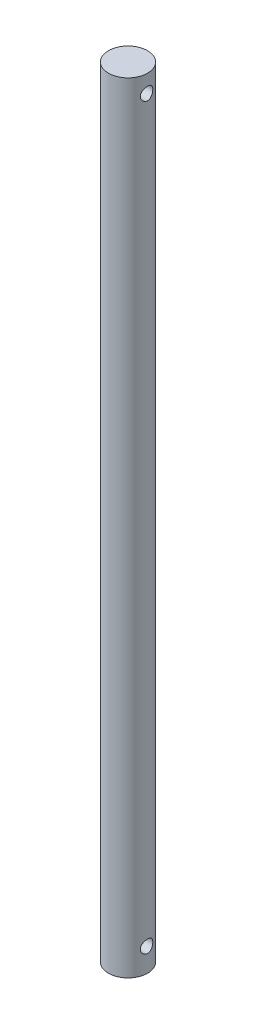
ISO-10303-21;
HEADER;
FILE_DESCRIPTION(('STEP AP214'),'2;1');
FILE_NAME('part.step','',(''),(''),'','','');
FILE_SCHEMA(('AUTOMOTIVE_DESIGN { 1 0 10303 214 1 1 1 1 }'));
ENDSEC;
DATA;
#1=APPLICATION_CONTEXT('core data for automotive mechanical design processes');
#2=APPLICATION_PROTOCOL_DEFINITION('international standard','automotive_design',2000,#1);
#3=PRODUCT_CONTEXT('',#1,'mechanical');
#4=PRODUCT('Part','Part','',(#3));
#5=PRODUCT_RELATED_PRODUCT_CATEGORY('part','',(#4));
#6=PRODUCT_DEFINITION_FORMATION('','',#4);
#7=PRODUCT_DEFINITION_CONTEXT('part definition',#1,'design');
#8=PRODUCT_DEFINITION('design','',#6,#7);
#9=PRODUCT_DEFINITION_SHAPE('','',#8);
#10=(LENGTH_UNIT() NAMED_UNIT(*) SI_UNIT(.MILLI.,.METRE.));
#11=(NAMED_UNIT(*) PLANE_ANGLE_UNIT() SI_UNIT($,.RADIAN.));
#12=(NAMED_UNIT(*) SI_UNIT($,.STERADIAN.) SOLID_ANGLE_UNIT());
#13=UNCERTAINTY_MEASURE_WITH_UNIT(LENGTH_MEASURE(1.E-05),#10,'distance_accuracy_value','');
#14=(GEOMETRIC_REPRESENTATION_CONTEXT(3) GLOBAL_UNCERTAINTY_ASSIGNED_CONTEXT((#13)) GLOBAL_UNIT_ASSIGNED_CONTEXT((#10,
#11,#12)) REPRESENTATION_CONTEXT('',''));
#15=CARTESIAN_POINT('',(0.,0.,0.));
#16=DIRECTION('',(0.,0.,1.));
#17=DIRECTION('',(1.,0.,0.));
#18=AXIS2_PLACEMENT_3D('',#15,#16,#17);
#19=CARTESIAN_POINT('',(0.,399.034,0.));
#20=DIRECTION('',(0.,-1.,0.));
#21=DIRECTION('',(0.,0.,-1.));
#22=AXIS2_PLACEMENT_3D('',#19,#20,#21);
#23=PLANE('',#22);
#24=CARTESIAN_POINT('',(0.,399.034,0.));
#25=DIRECTION('',(0.,-1.,0.));
#26=DIRECTION('',(0.,0.,-1.));
#27=AXIS2_PLACEMENT_3D('',#24,#25,#26);
#28=CIRCLE('',#27,10.);
#29=CARTESIAN_POINT('',(0.,399.034,-10.));
#30=VERTEX_POINT('',#29);
#31=EDGE_CURVE('E73',#30,#30,#28,.T.);
#32=ORIENTED_EDGE('',*,*,#31,.F.);
#33=EDGE_LOOP('',(#32));
#34=FACE_BOUND('',#33,.T.);
#35=ADVANCED_FACE('F31',(#34),#23,.F.);
#36=CARTESIAN_POINT('',(0.,0.,0.));
#37=DIRECTION('',(0.,-1.,0.));
#38=DIRECTION('',(0.,0.,-1.));
#39=AXIS2_PLACEMENT_3D('',#36,#37,#38);
#40=CYLINDRICAL_SURFACE('',#39,10.);
#41=CARTESIAN_POINT('',(-9.47417542586161,12.,-3.2));
#42=CARTESIAN_POINT('',(-9.47417597596529,11.8252675240217,-3.19999948748241));
#43=CARTESIAN_POINT('',(-9.47906219195895,11.6505289924909,-3.18563986333058));
#44=CARTESIAN_POINT('',(-9.49798743796998,11.3062008247597,-3.12875538344883));
#45=CARTESIAN_POINT('',(-9.51202859144488,11.1366123926612,-3.08622399333436));
#46=CARTESIAN_POINT('',(-9.54751402925731,10.8076237967184,-2.97462043765107));
#47=CARTESIAN_POINT('',(-9.56894471348064,10.6482055493959,-2.90559700333832));
#48=CARTESIAN_POINT('',(-9.61677531099797,10.3431647179559,-2.74313268908806));
#49=CARTESIAN_POINT('',(-9.64317618145327,10.1975447992626,-2.6496871045708));
#50=CARTESIAN_POINT('',(-9.69903937529536,9.91898720973653,-2.43742483906297));
#51=CARTESIAN_POINT('',(-9.72857356061098,9.7866196690505,-2.31787869458639));
#52=CARTESIAN_POINT('',(-9.78676560427288,9.54342714827223,-2.05836824466033));
#53=CARTESIAN_POINT('',(-9.81542333344964,9.43260533075562,-1.91840094697461));
#54=CARTESIAN_POINT('',(-9.86945906171126,9.23310922940001,-1.61789884492554));
#55=CARTESIAN_POINT('',(-9.89474262289425,9.14502570138148,-1.45695337572198));
#56=CARTESIAN_POINT('',(-9.93833941290931,8.99740287206874,-1.12158438701709));
#57=CARTESIAN_POINT('',(-9.95665436412906,8.93785651647464,-0.947164210813368));
#58=CARTESIAN_POINT('',(-9.98374156030321,8.85091244154329,-0.595769420238151));
#59=CARTESIAN_POINT('',(-9.99280261988359,8.82253948467678,-0.419058777748383));
#60=CARTESIAN_POINT('',(-10.0013829623879,8.79565378899779,-0.0631682598409807));
#61=CARTESIAN_POINT('',(-10.0009045165927,8.79713394239642,0.116011017661705));
#62=CARTESIAN_POINT('',(-9.99065895983166,8.82927900394473,0.46487498333391));
#63=CARTESIAN_POINT('',(-9.98122856275874,8.85888599568119,0.634668632607027));
#64=CARTESIAN_POINT('',(-9.9545558794711,8.94470364648235,0.966736587299292));
#65=CARTESIAN_POINT('',(-9.93731307593572,9.00091606731206,1.12901039398623));
#66=CARTESIAN_POINT('',(-9.89650924003928,9.13900646503544,1.44382789922966));
#67=CARTESIAN_POINT('',(-9.87287146660126,9.22119836318636,1.59622354374657));
#68=CARTESIAN_POINT('',(-9.82175766841644,9.40866041379786,1.88538287482271));
#69=CARTESIAN_POINT('',(-9.79428063837074,9.51393661494408,2.02214245001061));
#70=CARTESIAN_POINT('',(-9.73698938358848,9.74997528346341,2.28245105048536));
#71=CARTESIAN_POINT('',(-9.70712548953852,9.88164872610375,2.40516427559648));
#72=CARTESIAN_POINT('',(-9.64945167915512,10.1639765219705,2.62702414716751));
#73=CARTESIAN_POINT('',(-9.62164203019799,10.3146333391531,2.72616772956348));
#74=CARTESIAN_POINT('',(-9.57096714718232,10.6331134805527,2.89911048763164));
#75=CARTESIAN_POINT('',(-9.54816651520166,10.8011241506088,2.97258500870697));
#76=CARTESIAN_POINT('',(-9.51084502816611,11.1480416126375,3.0899292349732));
#77=CARTESIAN_POINT('',(-9.49632102597734,11.3269442343381,3.13381019408681));
#78=CARTESIAN_POINT('',(-9.47790063591906,11.6825278202122,3.18907786384485));
#79=CARTESIAN_POINT('',(-9.47358408719401,11.8589872966575,3.20175015508952));
#80=CARTESIAN_POINT('',(-9.47489797544712,12.2115285410692,3.19786135813747));
#81=CARTESIAN_POINT('',(-9.48052678275551,12.3876103661848,3.18130505940762));
#82=CARTESIAN_POINT('',(-9.50068088288853,12.7287540546895,3.12058026689559));
#83=CARTESIAN_POINT('',(-9.51492688986554,12.8939882933978,3.07727773142789));
#84=CARTESIAN_POINT('',(-9.55041030162889,13.2148223194797,2.96531424580086));
#85=CARTESIAN_POINT('',(-9.5716488826307,13.3704204807409,2.89664902916759));
#86=CARTESIAN_POINT('',(-9.61950884733194,13.6726956943237,2.73357916810069));
#87=CARTESIAN_POINT('',(-9.64627168789195,13.8189691176186,2.63846893911339));
#88=CARTESIAN_POINT('',(-9.7018783866565,14.0939468443676,2.42602399530557));
#89=CARTESIAN_POINT('',(-9.73072281011003,14.2226463480166,2.30868322966909));
#90=CARTESIAN_POINT('',(-9.78877025045593,14.4646382212684,2.04900195609836));
#91=CARTESIAN_POINT('',(-9.81793369813727,14.5770096031674,1.90579198298008));
#92=CARTESIAN_POINT('',(-9.87207731058433,14.7761701545534,1.60183776977253));
#93=CARTESIAN_POINT('',(-9.89705765393074,14.862960416243,1.44109427868983));
#94=CARTESIAN_POINT('',(-9.93988578323935,15.0076719945354,1.10756752180852));
#95=CARTESIAN_POINT('',(-9.95778352281728,15.0657962368275,0.934879051113338));
#96=CARTESIAN_POINT('',(-9.9846484932616,15.1519682082215,0.581499965650404));
#97=CARTESIAN_POINT('',(-9.99361866877497,15.1800258546538,0.400812009966613));
#98=CARTESIAN_POINT('',(-10.0014130503861,15.2044314157995,0.0450212703250095));
#99=CARTESIAN_POINT('',(-10.0006619581795,15.2021066300598,-0.129982208988878));
#100=CARTESIAN_POINT('',(-9.990125511942,15.1690458304435,-0.476990875820558));
#101=CARTESIAN_POINT('',(-9.98034079636578,15.1383118243993,-0.648996274353536));
#102=CARTESIAN_POINT('',(-9.95297868315481,15.0501634584681,-0.982806083184512));
#103=CARTESIAN_POINT('',(-9.93550954998843,14.9931192551087,-1.14471773714632));
#104=CARTESIAN_POINT('',(-9.89457847944627,14.8543067808554,-1.45674507420833));
#105=CARTESIAN_POINT('',(-9.87111549176467,14.7725341763308,-1.60685868389727));
#106=CARTESIAN_POINT('',(-9.81961108395006,14.5832777844292,-1.89675571330933));
#107=CARTESIAN_POINT('',(-9.7914380507585,14.4749935275912,-2.03599290546539));
#108=CARTESIAN_POINT('',(-9.73404767984889,14.2371814483193,-2.29475841560531));
#109=CARTESIAN_POINT('',(-9.70483002448992,14.1076471206118,-2.41428067572616));
#110=CARTESIAN_POINT('',(-9.64743064993378,13.8255467087277,-2.63448393047812));
#111=CARTESIAN_POINT('',(-9.61932168852476,13.6723299958571,-2.73435281796463));
#112=CARTESIAN_POINT('',(-9.56861935653345,13.3504305886542,-2.90682777364151));
#113=CARTESIAN_POINT('',(-9.54602402656828,13.1817534179145,-2.97944353174495));
#114=CARTESIAN_POINT('',(-9.51051736579668,12.8460343177833,-3.09083212772817));
#115=CARTESIAN_POINT('',(-9.49703147588917,12.6797296882286,-3.13164502117033));
#116=CARTESIAN_POINT('',(-9.4788614617525,12.342284402362,-3.18622544347289));
#117=CARTESIAN_POINT('',(-9.47417488705192,12.1711451059091,-3.20000050199527));
#118=CARTESIAN_POINT('',(-9.47417542586161,12.,-3.2));
#119=B_SPLINE_CURVE_WITH_KNOTS('',3,(#41,#42,#43,#44,#45,#46,#47,#48,#49,#50,#51,#52,#53,#54,
#55,#56,#57,#58,#59,#60,#61,#62,#63,#64,#65,#66,#67,#68,#69,#70,#71,#72,#73,#74,#75,#76,#77,#78,
#79,#80,#81,#82,#83,#84,#85,#86,#87,#88,#89,#90,#91,#92,#93,#94,#95,#96,#97,#98,#99,#100,#101,
#102,#103,#104,#105,#106,#107,#108,#109,#110,#111,#112,#113,#114,#115,#116,#117,#118),
.UNSPECIFIED.,.T.,.F.,(4,2,2,2,2,2,2,2,2,2,2,2,2,2,2,2,2,2,2,2,2,2,2,2,2,2,2,2,2,2,2,2,2,2,2,2,
2,2,4),(0.,0.523564674172284,1.0472508306648,1.56997826478679,2.09280646922704,2.63272434433933,
3.17272141122681,3.72558754982145,4.2783169510497,4.8132134883914,5.34798267261194,
5.86340254805635,6.37885655848016,6.90079380151692,7.42286796941231,7.96770136648513,
8.51260555345556,9.06417123638576,9.61552704991908,10.143759826717,10.6719060540588,
11.1837891269488,11.6957583473223,12.2229730659105,12.7503314910767,13.3007734478392,
13.8511918997182,14.3976559377886,14.9439396716354,15.4664410564686,15.9889055161438,
16.5042337176069,17.0196522822778,17.5531298275023,18.0867709917439,18.6392120202663,
19.1914564406026,19.7044148674947,20.2172304223009),.UNSPECIFIED.);
#120=CARTESIAN_POINT('',(-9.47417542586161,12.,-3.2));
#121=VERTEX_POINT('',#120);
#122=EDGE_CURVE('E10',#121,#121,#119,.T.);
#123=ORIENTED_EDGE('',*,*,#122,.F.);
#124=EDGE_LOOP('',(#123));
#125=FACE_BOUND('',#124,.T.);
#126=CARTESIAN_POINT('',(9.47417542586161,12.,-3.2));
#127=CARTESIAN_POINT('',(9.47417597596529,12.1747324759783,-3.19999948748241));
#128=CARTESIAN_POINT('',(9.47906219195895,12.3494710075091,-3.18563986333058));
#129=CARTESIAN_POINT('',(9.49798743796998,12.6937991752403,-3.12875538344883));
#130=CARTESIAN_POINT('',(9.51202859144488,12.8633876073388,-3.08622399333436));
#131=CARTESIAN_POINT('',(9.54751402925731,13.1923762032816,-2.97462043765107));
#132=CARTESIAN_POINT('',(9.56894471348064,13.3517944506041,-2.90559700333832));
#133=CARTESIAN_POINT('',(9.61677531099797,13.6568352820441,-2.74313268908806));
#134=CARTESIAN_POINT('',(9.64317618145327,13.8024552007374,-2.6496871045708));
#135=CARTESIAN_POINT('',(9.69903937529536,14.0810127902635,-2.43742483906297));
#136=CARTESIAN_POINT('',(9.72857356061098,14.2133803309495,-2.31787869458639));
#137=CARTESIAN_POINT('',(9.78676560427288,14.4565728517278,-2.05836824466034));
#138=CARTESIAN_POINT('',(9.81542333344964,14.5673946692444,-1.91840094697461));
#139=CARTESIAN_POINT('',(9.86945906171126,14.7668907706,-1.61789884492554));
#140=CARTESIAN_POINT('',(9.89474262289425,14.8549742986185,-1.45695337572198));
#141=CARTESIAN_POINT('',(9.93833941290931,15.0025971279313,-1.12158438701709));
#142=CARTESIAN_POINT('',(9.95665436412906,15.0621434835254,-0.947164210813368));
#143=CARTESIAN_POINT('',(9.98374156030321,15.1490875584567,-0.595769420238151));
#144=CARTESIAN_POINT('',(9.99280261988359,15.1774605153232,-0.419058777748383));
#145=CARTESIAN_POINT('',(10.0013829623879,15.2043462110022,-0.0631682598409807));
#146=CARTESIAN_POINT('',(10.0009045165927,15.2028660576036,0.116011017661705));
#147=CARTESIAN_POINT('',(9.99065895983166,15.1707209960553,0.46487498333391));
#148=CARTESIAN_POINT('',(9.98122856275874,15.1411140043188,0.634668632607027));
#149=CARTESIAN_POINT('',(9.9545558794711,15.0552963535177,0.966736587299292));
#150=CARTESIAN_POINT('',(9.93731307593572,14.9990839326879,1.12901039398623));
#151=CARTESIAN_POINT('',(9.89650924003928,14.8609935349646,1.44382789922966));
#152=CARTESIAN_POINT('',(9.87287146660126,14.7788016368136,1.59622354374657));
#153=CARTESIAN_POINT('',(9.82175766841644,14.5913395862021,1.88538287482271));
#154=CARTESIAN_POINT('',(9.79428063837075,14.4860633850559,2.02214245001061));
#155=CARTESIAN_POINT('',(9.73698938358848,14.2500247165366,2.28245105048536));
#156=CARTESIAN_POINT('',(9.70712548953852,14.1183512738962,2.40516427559648));
#157=CARTESIAN_POINT('',(9.64945167915512,13.8360234780295,2.62702414716751));
#158=CARTESIAN_POINT('',(9.62164203019799,13.6853666608469,2.72616772956348));
#159=CARTESIAN_POINT('',(9.57096714718232,13.3668865194473,2.89911048763164));
#160=CARTESIAN_POINT('',(9.54816651520166,13.1988758493912,2.97258500870697));
#161=CARTESIAN_POINT('',(9.51084502816611,12.8519583873625,3.0899292349732));
#162=CARTESIAN_POINT('',(9.49632102597734,12.6730557656619,3.13381019408681));
#163=CARTESIAN_POINT('',(9.47790063591906,12.3174721797878,3.18907786384485));
#164=CARTESIAN_POINT('',(9.47358408719401,12.1410127033425,3.20175015508952));
#165=CARTESIAN_POINT('',(9.47489797544712,11.7884714589308,3.19786135813747));
#166=CARTESIAN_POINT('',(9.48052678275551,11.6123896338152,3.18130505940762));
#167=CARTESIAN_POINT('',(9.50068088288853,11.2712459453105,3.12058026689559));
#168=CARTESIAN_POINT('',(9.51492688986554,11.1060117066022,3.07727773142789));
#169=CARTESIAN_POINT('',(9.55041030162889,10.7851776805203,2.96531424580086));
#170=CARTESIAN_POINT('',(9.5716488826307,10.6295795192591,2.89664902916759));
#171=CARTESIAN_POINT('',(9.61950884733194,10.3273043056763,2.7335791681007));
#172=CARTESIAN_POINT('',(9.64627168789195,10.1810308823814,2.6384689391134));
#173=CARTESIAN_POINT('',(9.7018783866565,9.90605315563245,2.42602399530557));
#174=CARTESIAN_POINT('',(9.73072281011003,9.77735365198339,2.30868322966909));
#175=CARTESIAN_POINT('',(9.78877025045593,9.53536177873159,2.04900195609836));
#176=CARTESIAN_POINT('',(9.81793369813727,9.42299039683255,1.90579198298008));
#177=CARTESIAN_POINT('',(9.87207731058433,9.22382984544657,1.60183776977253));
#178=CARTESIAN_POINT('',(9.89705765393074,9.13703958375704,1.44109427868983));
#179=CARTESIAN_POINT('',(9.93988578323935,8.99232800546458,1.10756752180852));
#180=CARTESIAN_POINT('',(9.95778352281728,8.93420376317245,0.934879051113338));
#181=CARTESIAN_POINT('',(9.9846484932616,8.84803179177853,0.581499965650404));
#182=CARTESIAN_POINT('',(9.99361866877497,8.81997414534619,0.400812009966613));
#183=CARTESIAN_POINT('',(10.0014130503861,8.7955685842005,0.0450212703250094));
#184=CARTESIAN_POINT('',(10.0006619581795,8.7978933699402,-0.129982208988878));
#185=CARTESIAN_POINT('',(9.990125511942,8.83095416955647,-0.476990875820558));
#186=CARTESIAN_POINT('',(9.98034079636578,8.86168817560073,-0.648996274353537));
#187=CARTESIAN_POINT('',(9.95297868315481,8.94983654153192,-0.982806083184512));
#188=CARTESIAN_POINT('',(9.93550954998843,9.0068807448913,-1.14471773714632));
#189=CARTESIAN_POINT('',(9.89457847944627,9.14569321914456,-1.45674507420833));
#190=CARTESIAN_POINT('',(9.87111549176467,9.22746582366924,-1.60685868389727));
#191=CARTESIAN_POINT('',(9.81961108395006,9.41672221557081,-1.89675571330932));
#192=CARTESIAN_POINT('',(9.7914380507585,9.52500647240882,-2.03599290546539));
#193=CARTESIAN_POINT('',(9.73404767984889,9.76281855168073,-2.29475841560531));
#194=CARTESIAN_POINT('',(9.70483002448992,9.89235287938818,-2.41428067572616));
#195=CARTESIAN_POINT('',(9.64743064993378,10.1744532912723,-2.63448393047812));
#196=CARTESIAN_POINT('',(9.61932168852476,10.3276700041429,-2.73435281796463));
#197=CARTESIAN_POINT('',(9.56861935653345,10.6495694113458,-2.90682777364151));
#198=CARTESIAN_POINT('',(9.54602402656828,10.8182465820855,-2.97944353174495));
#199=CARTESIAN_POINT('',(9.51051736579668,11.1539656822166,-3.09083212772817));
#200=CARTESIAN_POINT('',(9.49703147588917,11.3202703117714,-3.13164502117034));
#201=CARTESIAN_POINT('',(9.4788614617525,11.657715597638,-3.18622544347289));
#202=CARTESIAN_POINT('',(9.47417488705192,11.8288548940909,-3.20000050199527));
#203=CARTESIAN_POINT('',(9.47417542586161,12.,-3.2));
#204=B_SPLINE_CURVE_WITH_KNOTS('',3,(#126,#127,#128,#129,#130,#131,#132,#133,#134,#135,#136,
#137,#138,#139,#140,#141,#142,#143,#144,#145,#146,#147,#148,#149,#150,#151,#152,#153,#154,#155,
#156,#157,#158,#159,#160,#161,#162,#163,#164,#165,#166,#167,#168,#169,#170,#171,#172,#173,#174,
#175,#176,#177,#178,#179,#180,#181,#182,#183,#184,#185,#186,#187,#188,#189,#190,#191,#192,#193,
#194,#195,#196,#197,#198,#199,#200,#201,#202,#203),.UNSPECIFIED.,.T.,.F.,(4,2,2,2,2,2,2,2,2,2,2,
2,2,2,2,2,2,2,2,2,2,2,2,2,2,2,2,2,2,2,2,2,2,2,2,2,2,2,4),(0.,0.523564674172285,1.0472508306648,
1.56997826478679,2.09280646922704,2.63272434433933,3.17272141122681,3.72558754982145,
4.2783169510497,4.8132134883914,5.34798267261194,5.86340254805635,6.37885655848016,
6.90079380151692,7.42286796941231,7.96770136648513,8.51260555345556,9.06417123638576,
9.61552704991908,10.143759826717,10.6719060540588,11.1837891269488,11.6957583473223,
12.2229730659105,12.7503314910767,13.3007734478392,13.8511918997182,14.3976559377886,
14.9439396716354,15.4664410564686,15.9889055161438,16.5042337176069,17.0196522822778,
17.5531298275023,18.0867709917439,18.6392120202663,19.1914564406026,19.7044148674947,
20.2172304223009),.UNSPECIFIED.);
#205=CARTESIAN_POINT('',(9.47417542586161,12.,-3.2));
#206=VERTEX_POINT('',#205);
#207=EDGE_CURVE('E40',#206,#206,#204,.T.);
#208=ORIENTED_EDGE('',*,*,#207,.F.);
#209=EDGE_LOOP('',(#208));
#210=FACE_BOUND('',#209,.T.);
#211=CARTESIAN_POINT('',(-9.47417542586162,390.034,-3.19999999999998));
#212=CARTESIAN_POINT('',(-9.47417597596529,389.859267524022,-3.19999948748239));
#213=CARTESIAN_POINT('',(-9.47906219195895,389.684528992491,-3.18563986333056));
#214=CARTESIAN_POINT('',(-9.49798743796998,389.34020082476,-3.12875538344881));
#215=CARTESIAN_POINT('',(-9.51202859144489,389.170612392661,-3.08622399333434));
#216=CARTESIAN_POINT('',(-9.54751402925731,388.841623796718,-2.97462043765105));
#217=CARTESIAN_POINT('',(-9.56894471348064,388.682205549396,-2.90559700333831));
#218=CARTESIAN_POINT('',(-9.61677531099797,388.377164717956,-2.74313268908805));
#219=CARTESIAN_POINT('',(-9.64317618145327,388.231544799263,-2.64968710457079));
#220=CARTESIAN_POINT('',(-9.69903937529536,387.952987209737,-2.43742483906296));
#221=CARTESIAN_POINT('',(-9.72857356061098,387.820619669051,-2.31787869458637));
#222=CARTESIAN_POINT('',(-9.78676560427288,387.577427148272,-2.05836824466033));
#223=CARTESIAN_POINT('',(-9.81542333344964,387.466605330756,-1.91840094697462));
#224=CARTESIAN_POINT('',(-9.86945906171125,387.2671092294,-1.61789884492555));
#225=CARTESIAN_POINT('',(-9.89474262289425,387.179025701382,-1.45695337572199));
#226=CARTESIAN_POINT('',(-9.93833941290931,387.031402872069,-1.12158438701709));
#227=CARTESIAN_POINT('',(-9.95665436412906,386.971856516475,-0.947164210813369));
#228=CARTESIAN_POINT('',(-9.98374156030321,386.884912441543,-0.595769420238162));
#229=CARTESIAN_POINT('',(-9.99280261988359,386.856539484677,-0.419058777748399));
#230=CARTESIAN_POINT('',(-10.0013829623879,386.829653788998,-0.0631682598409983));
#231=CARTESIAN_POINT('',(-10.0009045165927,386.831133942396,0.11601101766169));
#232=CARTESIAN_POINT('',(-9.99065895983166,386.863279003945,0.464874983333901));
#233=CARTESIAN_POINT('',(-9.98122856275874,386.892885995681,0.634668632607021));
#234=CARTESIAN_POINT('',(-9.9545558794711,386.978703646482,0.966736587299285));
#235=CARTESIAN_POINT('',(-9.93731307593572,387.034916067312,1.12901039398622));
#236=CARTESIAN_POINT('',(-9.89650924003928,387.173006465035,1.44382789922965));
#237=CARTESIAN_POINT('',(-9.87287146660126,387.255198363186,1.59622354374657));
#238=CARTESIAN_POINT('',(-9.82175766841644,387.442660413798,1.8853828748227));
#239=CARTESIAN_POINT('',(-9.79428063837075,387.547936614944,2.02214245001059));
#240=CARTESIAN_POINT('',(-9.73698938358848,387.783975283463,2.28245105048534));
#241=CARTESIAN_POINT('',(-9.70712548953852,387.915648726104,2.40516427559646));
#242=CARTESIAN_POINT('',(-9.64945167915512,388.19797652197,2.62702414716749));
#243=CARTESIAN_POINT('',(-9.621642030198,388.348633339153,2.72616772956346));
#244=CARTESIAN_POINT('',(-9.57096714718233,388.667113480553,2.8991104876316));
#245=CARTESIAN_POINT('',(-9.54816651520167,388.835124150609,2.97258500870692));
#246=CARTESIAN_POINT('',(-9.51084502816613,389.182041612638,3.08992923497317));
#247=CARTESIAN_POINT('',(-9.49632102597735,389.360944234338,3.13381019408678));
#248=CARTESIAN_POINT('',(-9.47790063591906,389.716527820212,3.18907786384483));
#249=CARTESIAN_POINT('',(-9.47358408719401,389.892987296657,3.2017501550895));
#250=CARTESIAN_POINT('',(-9.47489797544713,390.245528541069,3.19786135813745));
#251=CARTESIAN_POINT('',(-9.48052678275552,390.421610366185,3.1813050594076));
#252=CARTESIAN_POINT('',(-9.50068088288854,390.762754054689,3.12058026689557));
#253=CARTESIAN_POINT('',(-9.51492688986555,390.927988293398,3.07727773142786));
#254=CARTESIAN_POINT('',(-9.5504103016289,391.24882231948,2.96531424580083));
#255=CARTESIAN_POINT('',(-9.5716488826307,391.404420480741,2.89664902916756));
#256=CARTESIAN_POINT('',(-9.61950884733195,391.706695694324,2.73357916810065));
#257=CARTESIAN_POINT('',(-9.64627168789197,391.852969117619,2.63846893911333));
#258=CARTESIAN_POINT('',(-9.70187838665652,392.127946844368,2.4260239953055));
#259=CARTESIAN_POINT('',(-9.73072281011004,392.256646348017,2.30868322966904));
#260=CARTESIAN_POINT('',(-9.78877025045594,392.498638221268,2.04900195609835));
#261=CARTESIAN_POINT('',(-9.81793369813727,392.611009603167,1.90579198298006));
#262=CARTESIAN_POINT('',(-9.87207731058433,392.810170154553,1.60183776977251));
#263=CARTESIAN_POINT('',(-9.89705765393074,392.896960416243,1.44109427868982));
#264=CARTESIAN_POINT('',(-9.93988578323935,393.041671994535,1.10756752180852));
#265=CARTESIAN_POINT('',(-9.95778352281728,393.099796236828,0.934879051113337));
#266=CARTESIAN_POINT('',(-9.9846484932616,393.185968208221,0.581499965650405));
#267=CARTESIAN_POINT('',(-9.99361866877497,393.214025854654,0.400812009966619));
#268=CARTESIAN_POINT('',(-10.0014130503861,393.238431415799,0.0450212703250216));
#269=CARTESIAN_POINT('',(-10.0006619581795,393.23610663006,-0.129982208988865));
#270=CARTESIAN_POINT('',(-9.99012551194201,393.203045830443,-0.476990875820545));
#271=CARTESIAN_POINT('',(-9.98034079636578,393.172311824399,-0.648996274353525));
#272=CARTESIAN_POINT('',(-9.95297868315481,393.084163458468,-0.982806083184494));
#273=CARTESIAN_POINT('',(-9.93550954998843,393.027119255109,-1.14471773714629));
#274=CARTESIAN_POINT('',(-9.89457847944627,392.888306780855,-1.4567450742083));
#275=CARTESIAN_POINT('',(-9.87111549176468,392.806534176331,-1.60685868389725));
#276=CARTESIAN_POINT('',(-9.81961108395006,392.617277784429,-1.89675571330931));
#277=CARTESIAN_POINT('',(-9.7914380507585,392.508993527591,-2.03599290546539));
#278=CARTESIAN_POINT('',(-9.73404767984889,392.271181448319,-2.29475841560531));
#279=CARTESIAN_POINT('',(-9.70483002448993,392.141647120612,-2.41428067572616));
#280=CARTESIAN_POINT('',(-9.64743064993379,391.859546708728,-2.63448393047811));
#281=CARTESIAN_POINT('',(-9.61932168852476,391.706329995857,-2.73435281796462));
#282=CARTESIAN_POINT('',(-9.56861935653346,391.384430588654,-2.90682777364149));
#283=CARTESIAN_POINT('',(-9.54602402656829,391.215753417915,-2.97944353174493));
#284=CARTESIAN_POINT('',(-9.51051736579669,390.880034317783,-3.09083212772815));
#285=CARTESIAN_POINT('',(-9.49703147588917,390.713729688229,-3.13164502117032));
#286=CARTESIAN_POINT('',(-9.47886146175251,390.376284402362,-3.18622544347287));
#287=CARTESIAN_POINT('',(-9.47417488705192,390.205145105909,-3.20000050199524));
#288=CARTESIAN_POINT('',(-9.47417542586162,390.034,-3.19999999999998));
#289=B_SPLINE_CURVE_WITH_KNOTS('',3,(#211,#212,#213,#214,#215,#216,#217,#218,#219,#220,#221,
#222,#223,#224,#225,#226,#227,#228,#229,#230,#231,#232,#233,#234,#235,#236,#237,#238,#239,#240,
#241,#242,#243,#244,#245,#246,#247,#248,#249,#250,#251,#252,#253,#254,#255,#256,#257,#258,#259,
#260,#261,#262,#263,#264,#265,#266,#267,#268,#269,#270,#271,#272,#273,#274,#275,#276,#277,#278,
#279,#280,#281,#282,#283,#284,#285,#286,#287,#288),.UNSPECIFIED.,.T.,.F.,(4,2,2,2,2,2,2,2,2,2,2,
2,2,2,2,2,2,2,2,2,2,2,2,2,2,2,2,2,2,2,2,2,2,2,2,2,2,2,4),(0.,0.523564674172245,1.04725083066479,
1.56997826478676,2.09280646922699,2.63272434433929,3.17272141122677,3.7255875498214,
4.27831695104964,4.81321348839134,5.34798267261188,5.8634025480563,6.37885655848009,
6.90079380151688,7.42286796941227,7.96770136648507,8.51260555345549,9.06417123638567,
9.615527049919,10.1437598267169,10.6719060540587,11.1837891269487,11.6957583473222,
12.2229730659106,12.7503314910766,13.3007734478391,13.8511918997181,14.3976559377885,
14.9439396716353,15.4664410564685,15.9889055161437,16.5042337176068,17.0196522822777,
17.5531298275022,18.0867709917438,18.6392120202663,19.1914564406024,19.7044148674946,
20.2172304223007),.UNSPECIFIED.);
#290=CARTESIAN_POINT('',(-9.47417542586162,390.034,-3.19999999999998));
#291=VERTEX_POINT('',#290);
#292=EDGE_CURVE('E44',#291,#291,#289,.T.);
#293=ORIENTED_EDGE('',*,*,#292,.F.);
#294=EDGE_LOOP('',(#293));
#295=FACE_BOUND('',#294,.T.);
#296=CARTESIAN_POINT('',(9.47417542586162,390.034,-3.19999999999998));
#297=CARTESIAN_POINT('',(9.47417597596529,390.208732475978,-3.19999948748239));
#298=CARTESIAN_POINT('',(9.47906219195895,390.383471007509,-3.18563986333056));
#299=CARTESIAN_POINT('',(9.49798743796999,390.72779917524,-3.1287553834488));
#300=CARTESIAN_POINT('',(9.51202859144489,390.897387607339,-3.08622399333433));
#301=CARTESIAN_POINT('',(9.54751402925731,391.226376203282,-2.97462043765105));
#302=CARTESIAN_POINT('',(9.56894471348064,391.385794450604,-2.90559700333831));
#303=CARTESIAN_POINT('',(9.61677531099797,391.690835282044,-2.74313268908805));
#304=CARTESIAN_POINT('',(9.64317618145327,391.836455200737,-2.64968710457079));
#305=CARTESIAN_POINT('',(9.69903937529536,392.115012790263,-2.43742483906296));
#306=CARTESIAN_POINT('',(9.72857356061098,392.247380330949,-2.31787869458637));
#307=CARTESIAN_POINT('',(9.78676560427288,392.490572851728,-2.05836824466033));
#308=CARTESIAN_POINT('',(9.81542333344964,392.601394669244,-1.91840094697462));
#309=CARTESIAN_POINT('',(9.86945906171125,392.8008907706,-1.61789884492556));
#310=CARTESIAN_POINT('',(9.89474262289425,392.888974298618,-1.456953375722));
#311=CARTESIAN_POINT('',(9.9383394129093,393.036597127931,-1.1215843870171));
#312=CARTESIAN_POINT('',(9.95665436412906,393.096143483525,-0.947164210813376));
#313=CARTESIAN_POINT('',(9.98374156030321,393.183087558457,-0.59576942023816));
#314=CARTESIAN_POINT('',(9.99280261988359,393.211460515323,-0.419058777748396));
#315=CARTESIAN_POINT('',(10.0013829623879,393.238346211002,-0.0631682598409957));
#316=CARTESIAN_POINT('',(10.0009045165927,393.236866057604,0.116011017661691));
#317=CARTESIAN_POINT('',(9.99065895983166,393.204720996055,0.464874983333901));
#318=CARTESIAN_POINT('',(9.98122856275874,393.175114004319,0.634668632607021));
#319=CARTESIAN_POINT('',(9.9545558794711,393.089296353518,0.966736587299285));
#320=CARTESIAN_POINT('',(9.93731307593572,393.033083932688,1.12901039398622));
#321=CARTESIAN_POINT('',(9.89650924003928,392.894993534965,1.44382789922965));
#322=CARTESIAN_POINT('',(9.87287146660126,392.812801636814,1.59622354374657));
#323=CARTESIAN_POINT('',(9.82175766841644,392.625339586202,1.8853828748227));
#324=CARTESIAN_POINT('',(9.79428063837075,392.520063385056,2.02214245001059));
#325=CARTESIAN_POINT('',(9.73698938358848,392.284024716537,2.28245105048534));
#326=CARTESIAN_POINT('',(9.70712548953852,392.152351273896,2.40516427559646));
#327=CARTESIAN_POINT('',(9.64945167915512,391.87002347803,2.62702414716749));
#328=CARTESIAN_POINT('',(9.621642030198,391.719366660847,2.72616772956346));
#329=CARTESIAN_POINT('',(9.57096714718233,391.400886519447,2.8991104876316));
#330=CARTESIAN_POINT('',(9.54816651520167,391.232875849391,2.97258500870692));
#331=CARTESIAN_POINT('',(9.51084502816613,390.885958387362,3.08992923497317));
#332=CARTESIAN_POINT('',(9.49632102597735,390.707055765662,3.13381019408678));
#333=CARTESIAN_POINT('',(9.47790063591906,390.351472179788,3.18907786384483));
#334=CARTESIAN_POINT('',(9.47358408719401,390.175012703343,3.2017501550895));
#335=CARTESIAN_POINT('',(9.47489797544713,389.822471458931,3.19786135813745));
#336=CARTESIAN_POINT('',(9.48052678275552,389.646389633815,3.1813050594076));
#337=CARTESIAN_POINT('',(9.50068088288854,389.305245945311,3.12058026689557));
#338=CARTESIAN_POINT('',(9.51492688986555,389.140011706602,3.07727773142786));
#339=CARTESIAN_POINT('',(9.5504103016289,388.81917768052,2.96531424580083));
#340=CARTESIAN_POINT('',(9.5716488826307,388.663579519259,2.89664902916757));
#341=CARTESIAN_POINT('',(9.61950884733195,388.361304305676,2.73357916810067));
#342=CARTESIAN_POINT('',(9.64627168789196,388.215030882381,2.63846893911335));
#343=CARTESIAN_POINT('',(9.70187838665651,387.940053155632,2.42602399530553));
#344=CARTESIAN_POINT('',(9.73072281011004,387.811353651983,2.30868322966907));
#345=CARTESIAN_POINT('',(9.78877025045593,387.569361778732,2.04900195609835));
#346=CARTESIAN_POINT('',(9.81793369813727,387.456990396833,1.90579198298006));
#347=CARTESIAN_POINT('',(9.87207731058433,387.257829845447,1.60183776977251));
#348=CARTESIAN_POINT('',(9.89705765393074,387.171039583757,1.44109427868982));
#349=CARTESIAN_POINT('',(9.93988578323935,387.026328005465,1.10756752180852));
#350=CARTESIAN_POINT('',(9.95778352281728,386.968203763172,0.934879051113337));
#351=CARTESIAN_POINT('',(9.9846484932616,386.882031791779,0.581499965650405));
#352=CARTESIAN_POINT('',(9.99361866877497,386.853974145346,0.400812009966619));
#353=CARTESIAN_POINT('',(10.0014130503861,386.829568584201,0.0450212703250216));
#354=CARTESIAN_POINT('',(10.0006619581795,386.83189336994,-0.129982208988865));
#355=CARTESIAN_POINT('',(9.99012551194201,386.864954169557,-0.476990875820545));
#356=CARTESIAN_POINT('',(9.98034079636578,386.895688175601,-0.648996274353525));
#357=CARTESIAN_POINT('',(9.95297868315481,386.983836541532,-0.982806083184494));
#358=CARTESIAN_POINT('',(9.93550954998843,387.040880744891,-1.14471773714629));
#359=CARTESIAN_POINT('',(9.89457847944627,387.179693219145,-1.4567450742083));
#360=CARTESIAN_POINT('',(9.87111549176468,387.261465823669,-1.60685868389725));
#361=CARTESIAN_POINT('',(9.81961108395006,387.450722215571,-1.89675571330931));
#362=CARTESIAN_POINT('',(9.7914380507585,387.559006472409,-2.03599290546539));
#363=CARTESIAN_POINT('',(9.73404767984889,387.796818551681,-2.29475841560531));
#364=CARTESIAN_POINT('',(9.70483002448993,387.926352879388,-2.41428067572616));
#365=CARTESIAN_POINT('',(9.64743064993379,388.208453291272,-2.63448393047811));
#366=CARTESIAN_POINT('',(9.61932168852476,388.361670004143,-2.73435281796462));
#367=CARTESIAN_POINT('',(9.56861935653346,388.683569411346,-2.90682777364149));
#368=CARTESIAN_POINT('',(9.54602402656829,388.852246582085,-2.97944353174493));
#369=CARTESIAN_POINT('',(9.51051736579669,389.187965682217,-3.09083212772815));
#370=CARTESIAN_POINT('',(9.49703147588917,389.354270311771,-3.13164502117032));
#371=CARTESIAN_POINT('',(9.47886146175251,389.691715597638,-3.18622544347287));
#372=CARTESIAN_POINT('',(9.47417488705192,389.862854894091,-3.20000050199524));
#373=CARTESIAN_POINT('',(9.47417542586162,390.034,-3.19999999999998));
#374=B_SPLINE_CURVE_WITH_KNOTS('',3,(#296,#297,#298,#299,#300,#301,#302,#303,#304,#305,#306,
#307,#308,#309,#310,#311,#312,#313,#314,#315,#316,#317,#318,#319,#320,#321,#322,#323,#324,#325,
#326,#327,#328,#329,#330,#331,#332,#333,#334,#335,#336,#337,#338,#339,#340,#341,#342,#343,#344,
#345,#346,#347,#348,#349,#350,#351,#352,#353,#354,#355,#356,#357,#358,#359,#360,#361,#362,#363,
#364,#365,#366,#367,#368,#369,#370,#371,#372,#373),.UNSPECIFIED.,.T.,.F.,(4,2,2,2,2,2,2,2,2,2,2,
2,2,2,2,2,2,2,2,2,2,2,2,2,2,2,2,2,2,2,2,2,2,2,2,2,2,2,4),(0.,0.523564674172301,1.04725083066479,
1.56997826478676,2.09280646922699,2.63272434433929,3.17272141122677,3.72558754982138,
4.27831695104965,4.81321348839135,5.34798267261189,5.8634025480563,6.37885655848009,
6.90079380151688,7.42286796941227,7.96770136648508,8.51260555345549,9.06417123638567,
9.615527049919,10.1437598267169,10.6719060540587,11.1837891269487,11.6957583473222,
12.2229730659105,12.7503314910766,13.3007734478391,13.8511918997181,14.3976559377885,
14.9439396716353,15.4664410564685,15.9889055161437,16.5042337176068,17.0196522822777,
17.5531298275022,18.0867709917438,18.6392120202663,19.1914564406024,19.7044148674946,
20.2172304223007),.UNSPECIFIED.);
#375=CARTESIAN_POINT('',(9.47417542586162,390.034,-3.19999999999998));
#376=VERTEX_POINT('',#375);
#377=EDGE_CURVE('E48',#376,#376,#374,.T.);
#378=ORIENTED_EDGE('',*,*,#377,.F.);
#379=EDGE_LOOP('',(#378));
#380=FACE_BOUND('',#379,.T.);
#381=ORIENTED_EDGE('',*,*,#31,.T.);
#382=EDGE_LOOP('',(#381));
#383=FACE_BOUND('',#382,.T.);
#384=CARTESIAN_POINT('',(0.,0.,0.));
#385=DIRECTION('',(0.,-1.,0.));
#386=DIRECTION('',(0.,0.,-1.));
#387=AXIS2_PLACEMENT_3D('',#384,#385,#386);
#388=CIRCLE('',#387,10.);
#389=CARTESIAN_POINT('',(0.,0.,-10.));
#390=VERTEX_POINT('',#389);
#391=EDGE_CURVE('E76',#390,#390,#388,.T.);
#392=ORIENTED_EDGE('',*,*,#391,.F.);
#393=EDGE_LOOP('',(#392));
#394=FACE_BOUND('',#393,.T.);
#395=ADVANCED_FACE('F56',(#125,#210,#295,#380,#383,#394),#40,.T.);
#396=CARTESIAN_POINT('',(0.,0.,0.));
#397=DIRECTION('',(0.,-1.,0.));
#398=DIRECTION('',(0.,0.,-1.));
#399=AXIS2_PLACEMENT_3D('',#396,#397,#398);
#400=PLANE('',#399);
#401=ORIENTED_EDGE('',*,*,#391,.T.);
#402=EDGE_LOOP('',(#401));
#403=FACE_BOUND('',#402,.T.);
#404=ADVANCED_FACE('F66',(#403),#400,.T.);
#405=CARTESIAN_POINT('',(-10.,390.034,0.));
#406=DIRECTION('',(1.,0.,0.));
#407=DIRECTION('',(0.,0.,-1.));
#408=AXIS2_PLACEMENT_3D('',#405,#406,#407);
#409=CYLINDRICAL_SURFACE('',#408,3.19999999999998);
#410=ORIENTED_EDGE('',*,*,#292,.T.);
#411=EDGE_LOOP('',(#410));
#412=FACE_BOUND('',#411,.T.);
#413=ORIENTED_EDGE('',*,*,#377,.T.);
#414=EDGE_LOOP('',(#413));
#415=FACE_BOUND('',#414,.T.);
#416=ADVANCED_FACE('F62',(#412,#415),#409,.F.);
#417=CARTESIAN_POINT('',(-10.,12.,0.));
#418=DIRECTION('',(1.,0.,0.));
#419=DIRECTION('',(0.,0.,-1.));
#420=AXIS2_PLACEMENT_3D('',#417,#418,#419);
#421=CYLINDRICAL_SURFACE('',#420,3.2);
#422=ORIENTED_EDGE('',*,*,#122,.T.);
#423=EDGE_LOOP('',(#422));
#424=FACE_BOUND('',#423,.T.);
#425=ORIENTED_EDGE('',*,*,#207,.T.);
#426=EDGE_LOOP('',(#425));
#427=FACE_BOUND('',#426,.T.);
#428=ADVANCED_FACE('F59',(#424,#427),#421,.F.);
#429=CLOSED_SHELL('',(#35,#395,#404,#416,#428));
#430=MANIFOLD_SOLID_BREP('B2',#429);
#431=ADVANCED_BREP_SHAPE_REPRESENTATION('',(#18,#430),#14);
#432=SHAPE_DEFINITION_REPRESENTATION(#9,#431);
ENDSEC;
END-ISO-10303-21;
